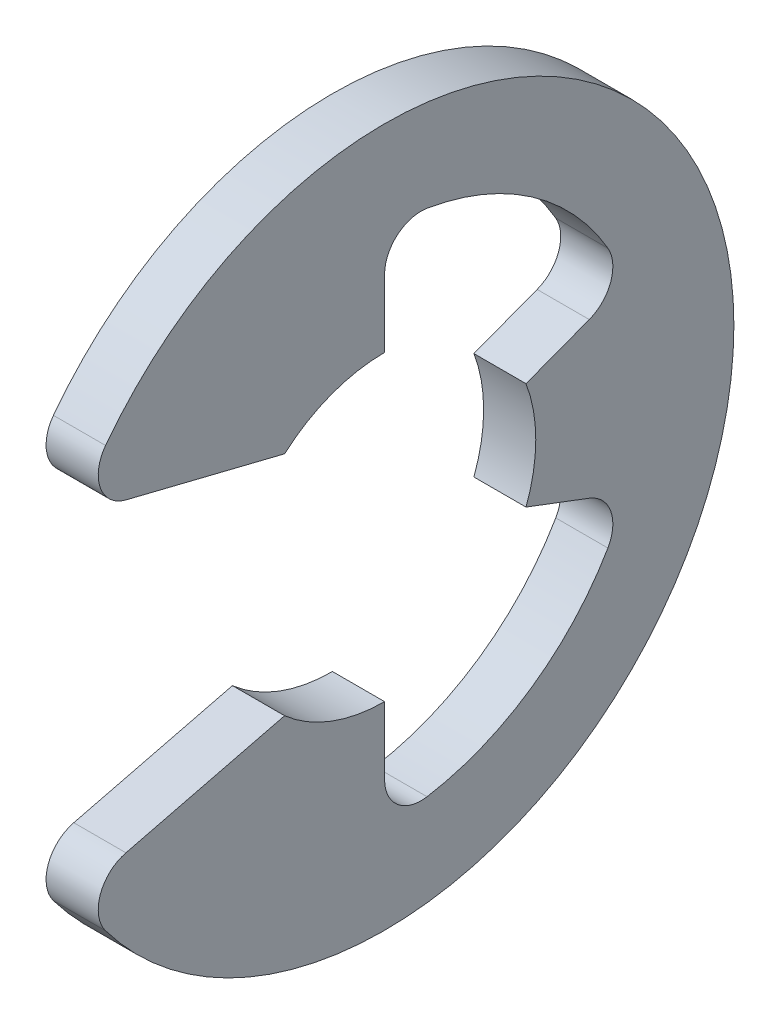
ISO-10303-21;
HEADER;
FILE_DESCRIPTION(('STEP AP214'),'2;1');
FILE_NAME('part.step','',(''),(''),'','','');
FILE_SCHEMA(('AUTOMOTIVE_DESIGN { 1 0 10303 214 1 1 1 1 }'));
ENDSEC;
DATA;
#1=APPLICATION_CONTEXT('core data for automotive mechanical design processes');
#2=APPLICATION_PROTOCOL_DEFINITION('international standard','automotive_design',2000,#1);
#3=PRODUCT_CONTEXT('',#1,'mechanical');
#4=PRODUCT('Part','Part','',(#3));
#5=PRODUCT_RELATED_PRODUCT_CATEGORY('part','',(#4));
#6=PRODUCT_DEFINITION_FORMATION('','',#4);
#7=PRODUCT_DEFINITION_CONTEXT('part definition',#1,'design');
#8=PRODUCT_DEFINITION('design','',#6,#7);
#9=PRODUCT_DEFINITION_SHAPE('','',#8);
#10=(LENGTH_UNIT() NAMED_UNIT(*) SI_UNIT(.MILLI.,.METRE.));
#11=(NAMED_UNIT(*) PLANE_ANGLE_UNIT() SI_UNIT($,.RADIAN.));
#12=(NAMED_UNIT(*) SI_UNIT($,.STERADIAN.) SOLID_ANGLE_UNIT());
#13=UNCERTAINTY_MEASURE_WITH_UNIT(LENGTH_MEASURE(1.E-05),#10,'distance_accuracy_value','');
#14=(GEOMETRIC_REPRESENTATION_CONTEXT(3) GLOBAL_UNCERTAINTY_ASSIGNED_CONTEXT((#13)) GLOBAL_UNIT_ASSIGNED_CONTEXT((#10,
#11,#12)) REPRESENTATION_CONTEXT('',''));
#15=CARTESIAN_POINT('',(0.,0.,0.));
#16=DIRECTION('',(0.,0.,1.));
#17=DIRECTION('',(1.,0.,0.));
#18=AXIS2_PLACEMENT_3D('',#15,#16,#17);
#19=CARTESIAN_POINT('',(0.3175,0.,0.));
#20=DIRECTION('',(-1.,0.,0.));
#21=DIRECTION('',(0.,0.,1.));
#22=AXIS2_PLACEMENT_3D('',#19,#20,#21);
#23=CYLINDRICAL_SURFACE('',#22,4.2545);
#24=CARTESIAN_POINT('',(0.3175,0.,0.));
#25=DIRECTION('',(1.,0.,0.));
#26=DIRECTION('',(0.,0.,-1.));
#27=AXIS2_PLACEMENT_3D('',#24,#25,#26);
#28=CIRCLE('',#27,4.2545);
#29=CARTESIAN_POINT('',(0.3175,-2.55970079348508,3.39833813765374));
#30=VERTEX_POINT('',#29);
#31=CARTESIAN_POINT('',(0.3175,2.55970079348508,3.39833813765374));
#32=VERTEX_POINT('',#31);
#33=EDGE_CURVE('E173',#30,#32,#28,.T.);
#34=ORIENTED_EDGE('',*,*,#33,.F.);
#35=DIRECTION('',(-1.,0.,0.));
#36=VECTOR('',#35,1.);
#37=CARTESIAN_POINT('',(0.3175,-2.55970079348508,3.39833813765374));
#38=LINE('',#37,#36);
#39=CARTESIAN_POINT('',(-0.3175,-2.55970079348508,3.39833813765374));
#40=VERTEX_POINT('',#39);
#41=EDGE_CURVE('E267',#30,#40,#38,.T.);
#42=ORIENTED_EDGE('',*,*,#41,.T.);
#43=CARTESIAN_POINT('',(-0.3175,0.,0.));
#44=DIRECTION('',(1.,0.,0.));
#45=DIRECTION('',(0.,0.,-1.));
#46=AXIS2_PLACEMENT_3D('',#43,#44,#45);
#47=CIRCLE('',#46,4.2545);
#48=CARTESIAN_POINT('',(-0.3175,2.55970079348508,3.39833813765374));
#49=VERTEX_POINT('',#48);
#50=EDGE_CURVE('E211',#40,#49,#47,.T.);
#51=ORIENTED_EDGE('',*,*,#50,.T.);
#52=DIRECTION('',(-1.,0.,0.));
#53=VECTOR('',#52,1.);
#54=CARTESIAN_POINT('',(0.3175,2.55970079348508,3.39833813765374));
#55=LINE('',#54,#53);
#56=EDGE_CURVE('E265',#49,#32,#55,.F.);
#57=ORIENTED_EDGE('',*,*,#56,.T.);
#58=EDGE_LOOP('',(#34,#42,#51,#57));
#59=FACE_BOUND('',#58,.T.);
#60=ADVANCED_FACE('F35',(#59),#23,.T.);
#61=CARTESIAN_POINT('',(0.3175,2.00970746878701,3.74991281764013));
#62=DIRECTION('',(0.,0.970536829925373,-0.240952820606873));
#63=DIRECTION('',(0.,0.240952820606873,0.970536829925373));
#64=AXIS2_PLACEMENT_3D('',#61,#62,#63);
#65=PLANE('',#64);
#66=DIRECTION('',(0.,-0.240952820606873,-0.970536829925373));
#67=VECTOR('',#66,1.);
#68=CARTESIAN_POINT('',(0.3175,2.00970746878701,3.74991281764013));
#69=LINE('',#68,#67);
#70=CARTESIAN_POINT('',(0.3175,1.86086574639824,3.15039141322579));
#71=VERTEX_POINT('',#70);
#72=CARTESIAN_POINT('',(0.3175,1.381125,1.21803775983136));
#73=VERTEX_POINT('',#72);
#74=EDGE_CURVE('E159',#71,#73,#69,.T.);
#75=ORIENTED_EDGE('',*,*,#74,.F.);
#76=DIRECTION('',(-1.,0.,0.));
#77=VECTOR('',#76,1.);
#78=CARTESIAN_POINT('',(0.3175,1.86086574639824,3.15039141322579));
#79=LINE('',#78,#77);
#80=CARTESIAN_POINT('',(-0.3175,1.86086574639824,3.15039141322579));
#81=VERTEX_POINT('',#80);
#82=EDGE_CURVE('E279',#71,#81,#79,.T.);
#83=ORIENTED_EDGE('',*,*,#82,.T.);
#84=DIRECTION('',(0.,-0.240952820606873,-0.970536829925373));
#85=VECTOR('',#84,1.);
#86=CARTESIAN_POINT('',(-0.3175,2.00970746878701,3.74991281764013));
#87=LINE('',#86,#85);
#88=CARTESIAN_POINT('',(-0.3175,1.381125,1.21803775983136));
#89=VERTEX_POINT('',#88);
#90=EDGE_CURVE('E179',#81,#89,#87,.T.);
#91=ORIENTED_EDGE('',*,*,#90,.T.);
#92=DIRECTION('',(-1.,0.,0.));
#93=VECTOR('',#92,1.);
#94=CARTESIAN_POINT('',(0.3175,1.381125,1.21803775983136));
#95=LINE('',#94,#93);
#96=EDGE_CURVE('E176',#73,#89,#95,.T.);
#97=ORIENTED_EDGE('',*,*,#96,.F.);
#98=EDGE_LOOP('',(#75,#83,#91,#97));
#99=FACE_BOUND('',#98,.T.);
#100=ADVANCED_FACE('F177',(#99),#65,.F.);
#101=CARTESIAN_POINT('',(0.3175,0.,0.));
#102=DIRECTION('',(-1.,0.,0.));
#103=DIRECTION('',(0.,0.,1.));
#104=AXIS2_PLACEMENT_3D('',#101,#102,#103);
#105=CYLINDRICAL_SURFACE('',#104,1.8415);
#106=CARTESIAN_POINT('',(-0.3175,0.,0.));
#107=DIRECTION('',(-1.,0.,0.));
#108=DIRECTION('',(0.,0.,1.));
#109=AXIS2_PLACEMENT_3D('',#106,#107,#108);
#110=CIRCLE('',#109,1.8415);
#111=CARTESIAN_POINT('',(-0.3175,1.8415,0.));
#112=VERTEX_POINT('',#111);
#113=EDGE_CURVE('E215',#89,#112,#110,.T.);
#114=ORIENTED_EDGE('',*,*,#113,.T.);
#115=DIRECTION('',(-1.,0.,0.));
#116=VECTOR('',#115,1.);
#117=CARTESIAN_POINT('',(0.3175,1.8415,0.));
#118=LINE('',#117,#116);
#119=CARTESIAN_POINT('',(0.3175,1.8415,0.));
#120=VERTEX_POINT('',#119);
#121=EDGE_CURVE('E183',#120,#112,#118,.T.);
#122=ORIENTED_EDGE('',*,*,#121,.F.);
#123=CARTESIAN_POINT('',(0.3175,0.,0.));
#124=DIRECTION('',(-1.,0.,0.));
#125=DIRECTION('',(0.,0.,1.));
#126=AXIS2_PLACEMENT_3D('',#123,#124,#125);
#127=CIRCLE('',#126,1.8415);
#128=EDGE_CURVE('E165',#73,#120,#127,.T.);
#129=ORIENTED_EDGE('',*,*,#128,.F.);
#130=ORIENTED_EDGE('',*,*,#96,.T.);
#131=EDGE_LOOP('',(#114,#122,#129,#130));
#132=FACE_BOUND('',#131,.T.);
#133=ADVANCED_FACE('F185',(#132),#105,.F.);
#134=CARTESIAN_POINT('',(0.3175,1.8415,0.));
#135=DIRECTION('',(0.,0.,1.));
#136=DIRECTION('',(0.,-1.,0.));
#137=AXIS2_PLACEMENT_3D('',#134,#135,#136);
#138=PLANE('',#137);
#139=DIRECTION('',(0.,1.,0.));
#140=VECTOR('',#139,1.);
#141=CARTESIAN_POINT('',(-0.3175,1.8415,0.));
#142=LINE('',#141,#140);
#143=CARTESIAN_POINT('',(-0.3175,2.66500750604648,0.));
#144=VERTEX_POINT('',#143);
#145=EDGE_CURVE('E217',#112,#144,#142,.T.);
#146=ORIENTED_EDGE('',*,*,#145,.T.);
#147=DIRECTION('',(1.,0.,0.));
#148=VECTOR('',#147,1.);
#149=CARTESIAN_POINT('',(0.3175,2.66500750604648,0.));
#150=LINE('',#149,#148);
#151=CARTESIAN_POINT('',(0.3175,2.66500750604648,0.));
#152=VERTEX_POINT('',#151);
#153=EDGE_CURVE('E263',#144,#152,#150,.T.);
#154=ORIENTED_EDGE('',*,*,#153,.T.);
#155=DIRECTION('',(0.,1.,0.));
#156=VECTOR('',#155,1.);
#157=CARTESIAN_POINT('',(0.3175,1.8415,0.));
#158=LINE('',#157,#156);
#159=EDGE_CURVE('E188',#120,#152,#158,.T.);
#160=ORIENTED_EDGE('',*,*,#159,.F.);
#161=ORIENTED_EDGE('',*,*,#121,.T.);
#162=EDGE_LOOP('',(#146,#154,#160,#161));
#163=FACE_BOUND('',#162,.T.);
#164=ADVANCED_FACE('F385',(#163),#138,.F.);
#165=CARTESIAN_POINT('',(0.3175,0.,0.));
#166=DIRECTION('',(-1.,0.,0.));
#167=DIRECTION('',(0.,0.,1.));
#168=AXIS2_PLACEMENT_3D('',#165,#166,#167);
#169=CYLINDRICAL_SURFACE('',#168,3.14632258064516);
#170=CARTESIAN_POINT('',(0.3175,0.,0.));
#171=DIRECTION('',(-1.,0.,0.));
#172=DIRECTION('',(0.,0.,-1.));
#173=AXIS2_PLACEMENT_3D('',#170,#171,#172);
#174=CIRCLE('',#173,3.14632258064516);
#175=CARTESIAN_POINT('',(0.3175,3.10345074244685,-0.517628506444275));
#176=VERTEX_POINT('',#175);
#177=CARTESIAN_POINT('',(0.3175,1.58143266371679,-2.72000303522022));
#178=VERTEX_POINT('',#177);
#179=EDGE_CURVE('E190',#176,#178,#174,.T.);
#180=ORIENTED_EDGE('',*,*,#179,.F.);
#181=DIRECTION('',(-1.,0.,0.));
#182=VECTOR('',#181,1.);
#183=CARTESIAN_POINT('',(0.3175,3.10345074244685,-0.517628506444275));
#184=LINE('',#183,#182);
#185=CARTESIAN_POINT('',(-0.3175,3.10345074244685,-0.517628506444275));
#186=VERTEX_POINT('',#185);
#187=EDGE_CURVE('E260',#176,#186,#184,.T.);
#188=ORIENTED_EDGE('',*,*,#187,.T.);
#189=CARTESIAN_POINT('',(-0.3175,0.,0.));
#190=DIRECTION('',(-1.,0.,0.));
#191=DIRECTION('',(0.,0.,-1.));
#192=AXIS2_PLACEMENT_3D('',#189,#190,#191);
#193=CIRCLE('',#192,3.14632258064516);
#194=CARTESIAN_POINT('',(-0.3175,1.58143266371679,-2.72000303522022));
#195=VERTEX_POINT('',#194);
#196=EDGE_CURVE('E220',#186,#195,#193,.T.);
#197=ORIENTED_EDGE('',*,*,#196,.T.);
#198=DIRECTION('',(-1.,0.,0.));
#199=VECTOR('',#198,1.);
#200=CARTESIAN_POINT('',(0.3175,1.58143266371679,-2.72000303522023));
#201=LINE('',#200,#199);
#202=EDGE_CURVE('E258',#195,#178,#201,.F.);
#203=ORIENTED_EDGE('',*,*,#202,.T.);
#204=EDGE_LOOP('',(#180,#188,#197,#203));
#205=FACE_BOUND('',#204,.T.);
#206=ADVANCED_FACE('F307',(#205),#169,.F.);
#207=CARTESIAN_POINT('',(0.3175,0.651068568777514,-1.72256551943605));
#208=DIRECTION('',(0.,-0.935414346693485,-0.353553390593274));
#209=DIRECTION('',(0.,0.353553390593274,-0.935414346693485));
#210=AXIS2_PLACEMENT_3D('',#207,#208,#209);
#211=PLANE('',#210);
#212=DIRECTION('',(0.,-0.353553390593274,0.935414346693485));
#213=VECTOR('',#212,1.);
#214=CARTESIAN_POINT('',(0.3175,0.651068568777514,-1.72256551943605));
#215=LINE('',#214,#213);
#216=CARTESIAN_POINT('',(0.3175,0.942222439719258,-2.4928862552017));
#217=VERTEX_POINT('',#216);
#218=CARTESIAN_POINT('',(0.3175,0.651068568777514,-1.72256551943605));
#219=VERTEX_POINT('',#218);
#220=EDGE_CURVE('E195',#217,#219,#215,.T.);
#221=ORIENTED_EDGE('',*,*,#220,.F.);
#222=DIRECTION('',(1.,0.,0.));
#223=VECTOR('',#222,1.);
#224=CARTESIAN_POINT('',(-0.3175,0.942222439719258,-2.4928862552017));
#225=LINE('',#224,#223);
#226=CARTESIAN_POINT('',(-0.3175,0.942222439719258,-2.4928862552017));
#227=VERTEX_POINT('',#226);
#228=EDGE_CURVE('E282',#217,#227,#225,.F.);
#229=ORIENTED_EDGE('',*,*,#228,.T.);
#230=DIRECTION('',(0.,-0.353553390593274,0.935414346693485));
#231=VECTOR('',#230,1.);
#232=CARTESIAN_POINT('',(-0.3175,0.651068568777514,-1.72256551943605));
#233=LINE('',#232,#231);
#234=CARTESIAN_POINT('',(-0.3175,0.651068568777514,-1.72256551943605));
#235=VERTEX_POINT('',#234);
#236=EDGE_CURVE('E223',#227,#235,#233,.T.);
#237=ORIENTED_EDGE('',*,*,#236,.T.);
#238=DIRECTION('',(-1.,0.,0.));
#239=VECTOR('',#238,1.);
#240=CARTESIAN_POINT('',(0.3175,0.651068568777514,-1.72256551943605));
#241=LINE('',#240,#239);
#242=EDGE_CURVE('E247',#219,#235,#241,.T.);
#243=ORIENTED_EDGE('',*,*,#242,.F.);
#244=EDGE_LOOP('',(#221,#229,#237,#243));
#245=FACE_BOUND('',#244,.T.);
#246=ADVANCED_FACE('F310',(#245),#211,.F.);
#247=CARTESIAN_POINT('',(0.3175,0.,0.));
#248=DIRECTION('',(-1.,0.,0.));
#249=DIRECTION('',(0.,0.,1.));
#250=AXIS2_PLACEMENT_3D('',#247,#248,#249);
#251=CYLINDRICAL_SURFACE('',#250,1.8415);
#252=CARTESIAN_POINT('',(-0.3175,0.,0.));
#253=DIRECTION('',(-1.,0.,0.));
#254=DIRECTION('',(0.,0.,1.));
#255=AXIS2_PLACEMENT_3D('',#252,#253,#254);
#256=CIRCLE('',#255,1.8415);
#257=CARTESIAN_POINT('',(-0.3175,-0.651068568777513,-1.72256551943605));
#258=VERTEX_POINT('',#257);
#259=EDGE_CURVE('E225',#235,#258,#256,.T.);
#260=ORIENTED_EDGE('',*,*,#259,.T.);
#261=DIRECTION('',(-1.,0.,0.));
#262=VECTOR('',#261,1.);
#263=CARTESIAN_POINT('',(0.3175,-0.651068568777513,-1.72256551943605));
#264=LINE('',#263,#262);
#265=CARTESIAN_POINT('',(0.3175,-0.651068568777513,-1.72256551943605));
#266=VERTEX_POINT('',#265);
#267=EDGE_CURVE('E244',#266,#258,#264,.T.);
#268=ORIENTED_EDGE('',*,*,#267,.F.);
#269=CARTESIAN_POINT('',(0.3175,0.,0.));
#270=DIRECTION('',(-1.,0.,0.));
#271=DIRECTION('',(0.,0.,1.));
#272=AXIS2_PLACEMENT_3D('',#269,#270,#271);
#273=CIRCLE('',#272,1.8415);
#274=EDGE_CURVE('E197',#219,#266,#273,.T.);
#275=ORIENTED_EDGE('',*,*,#274,.F.);
#276=ORIENTED_EDGE('',*,*,#242,.T.);
#277=EDGE_LOOP('',(#260,#268,#275,#276));
#278=FACE_BOUND('',#277,.T.);
#279=ADVANCED_FACE('F316',(#278),#251,.F.);
#280=CARTESIAN_POINT('',(0.3175,-0.651068568777513,-1.72256551943605));
#281=DIRECTION('',(0.,0.935414346693485,-0.353553390593274));
#282=DIRECTION('',(0.,0.353553390593274,0.935414346693485));
#283=AXIS2_PLACEMENT_3D('',#280,#281,#282);
#284=PLANE('',#283);
#285=DIRECTION('',(0.,-0.353553390593274,-0.935414346693485));
#286=VECTOR('',#285,1.);
#287=CARTESIAN_POINT('',(-0.3175,-0.651068568777513,-1.72256551943605));
#288=LINE('',#287,#286);
#289=CARTESIAN_POINT('',(-0.3175,-0.942222439719257,-2.4928862552017));
#290=VERTEX_POINT('',#289);
#291=EDGE_CURVE('E227',#258,#290,#288,.T.);
#292=ORIENTED_EDGE('',*,*,#291,.T.);
#293=DIRECTION('',(1.,0.,0.));
#294=VECTOR('',#293,1.);
#295=CARTESIAN_POINT('',(0.3175,-0.942222439719257,-2.4928862552017));
#296=LINE('',#295,#294);
#297=CARTESIAN_POINT('',(0.3175,-0.942222439719257,-2.4928862552017));
#298=VERTEX_POINT('',#297);
#299=EDGE_CURVE('E50',#290,#298,#296,.T.);
#300=ORIENTED_EDGE('',*,*,#299,.T.);
#301=DIRECTION('',(0.,-0.353553390593274,-0.935414346693485));
#302=VECTOR('',#301,1.);
#303=CARTESIAN_POINT('',(0.3175,-0.651068568777513,-1.72256551943605));
#304=LINE('',#303,#302);
#305=EDGE_CURVE('E199',#266,#298,#304,.T.);
#306=ORIENTED_EDGE('',*,*,#305,.F.);
#307=ORIENTED_EDGE('',*,*,#267,.T.);
#308=EDGE_LOOP('',(#292,#300,#306,#307));
#309=FACE_BOUND('',#308,.T.);
#310=ADVANCED_FACE('F318',(#309),#284,.F.);
#311=CARTESIAN_POINT('',(0.3175,0.,0.));
#312=DIRECTION('',(-1.,0.,0.));
#313=DIRECTION('',(0.,0.,1.));
#314=AXIS2_PLACEMENT_3D('',#311,#312,#313);
#315=CYLINDRICAL_SURFACE('',#314,3.14632258064516);
#316=CARTESIAN_POINT('',(-0.3175,0.,0.));
#317=DIRECTION('',(-1.,0.,0.));
#318=DIRECTION('',(0.,0.,-1.));
#319=AXIS2_PLACEMENT_3D('',#316,#317,#318);
#320=CIRCLE('',#319,3.14632258064516);
#321=CARTESIAN_POINT('',(-0.3175,-1.58143266371679,-2.72000303522023));
#322=VERTEX_POINT('',#321);
#323=CARTESIAN_POINT('',(-0.3175,-3.10345074244685,-0.517628506444276));
#324=VERTEX_POINT('',#323);
#325=EDGE_CURVE('E229',#322,#324,#320,.T.);
#326=ORIENTED_EDGE('',*,*,#325,.T.);
#327=DIRECTION('',(-1.,0.,0.));
#328=VECTOR('',#327,1.);
#329=CARTESIAN_POINT('',(0.3175,-3.10345074244685,-0.517628506444276));
#330=LINE('',#329,#328);
#331=CARTESIAN_POINT('',(0.3175,-3.10345074244685,-0.517628506444276));
#332=VERTEX_POINT('',#331);
#333=EDGE_CURVE('E256',#324,#332,#330,.F.);
#334=ORIENTED_EDGE('',*,*,#333,.T.);
#335=CARTESIAN_POINT('',(0.3175,0.,0.));
#336=DIRECTION('',(-1.,0.,0.));
#337=DIRECTION('',(0.,0.,-1.));
#338=AXIS2_PLACEMENT_3D('',#335,#336,#337);
#339=CIRCLE('',#338,3.14632258064516);
#340=CARTESIAN_POINT('',(0.3175,-1.58143266371679,-2.72000303522023));
#341=VERTEX_POINT('',#340);
#342=EDGE_CURVE('E201',#341,#332,#339,.T.);
#343=ORIENTED_EDGE('',*,*,#342,.F.);
#344=DIRECTION('',(-1.,0.,0.));
#345=VECTOR('',#344,1.);
#346=CARTESIAN_POINT('',(0.3175,-1.58143266371679,-2.72000303522023));
#347=LINE('',#346,#345);
#348=EDGE_CURVE('E253',#341,#322,#347,.T.);
#349=ORIENTED_EDGE('',*,*,#348,.T.);
#350=EDGE_LOOP('',(#326,#334,#343,#349));
#351=FACE_BOUND('',#350,.T.);
#352=ADVANCED_FACE('F320',(#351),#315,.F.);
#353=CARTESIAN_POINT('',(0.3175,-1.8415,0.));
#354=DIRECTION('',(0.,0.,1.));
#355=DIRECTION('',(0.,-1.,0.));
#356=AXIS2_PLACEMENT_3D('',#353,#354,#355);
#357=PLANE('',#356);
#358=DIRECTION('',(0.,1.,0.));
#359=VECTOR('',#358,1.);
#360=CARTESIAN_POINT('',(0.3175,-1.8415,0.));
#361=LINE('',#360,#359);
#362=CARTESIAN_POINT('',(0.3175,-2.66500750604648,0.));
#363=VERTEX_POINT('',#362);
#364=CARTESIAN_POINT('',(0.3175,-1.8415,0.));
#365=VERTEX_POINT('',#364);
#366=EDGE_CURVE('E204',#363,#365,#361,.T.);
#367=ORIENTED_EDGE('',*,*,#366,.F.);
#368=DIRECTION('',(1.,0.,0.));
#369=VECTOR('',#368,1.);
#370=CARTESIAN_POINT('',(-0.3175,-2.66500750604648,0.));
#371=LINE('',#370,#369);
#372=CARTESIAN_POINT('',(-0.3175,-2.66500750604648,0.));
#373=VERTEX_POINT('',#372);
#374=EDGE_CURVE('E182',#363,#373,#371,.F.);
#375=ORIENTED_EDGE('',*,*,#374,.T.);
#376=DIRECTION('',(0.,1.,0.));
#377=VECTOR('',#376,1.);
#378=CARTESIAN_POINT('',(-0.3175,-1.8415,0.));
#379=LINE('',#378,#377);
#380=CARTESIAN_POINT('',(-0.3175,-1.8415,0.));
#381=VERTEX_POINT('',#380);
#382=EDGE_CURVE('E232',#373,#381,#379,.T.);
#383=ORIENTED_EDGE('',*,*,#382,.T.);
#384=DIRECTION('',(-1.,0.,0.));
#385=VECTOR('',#384,1.);
#386=CARTESIAN_POINT('',(0.3175,-1.8415,0.));
#387=LINE('',#386,#385);
#388=EDGE_CURVE('E241',#365,#381,#387,.T.);
#389=ORIENTED_EDGE('',*,*,#388,.F.);
#390=EDGE_LOOP('',(#367,#375,#383,#389));
#391=FACE_BOUND('',#390,.T.);
#392=ADVANCED_FACE('F326',(#391),#357,.F.);
#393=CARTESIAN_POINT('',(0.3175,0.,0.));
#394=DIRECTION('',(-1.,0.,0.));
#395=DIRECTION('',(0.,0.,1.));
#396=AXIS2_PLACEMENT_3D('',#393,#394,#395);
#397=CYLINDRICAL_SURFACE('',#396,1.8415);
#398=CARTESIAN_POINT('',(-0.3175,0.,0.));
#399=DIRECTION('',(-1.,0.,0.));
#400=DIRECTION('',(0.,0.,-1.));
#401=AXIS2_PLACEMENT_3D('',#398,#399,#400);
#402=CIRCLE('',#401,1.8415);
#403=CARTESIAN_POINT('',(-0.3175,-1.381125,1.21803775983136));
#404=VERTEX_POINT('',#403);
#405=EDGE_CURVE('E234',#381,#404,#402,.T.);
#406=ORIENTED_EDGE('',*,*,#405,.T.);
#407=DIRECTION('',(-1.,0.,0.));
#408=VECTOR('',#407,1.);
#409=CARTESIAN_POINT('',(0.3175,-1.381125,1.21803775983136));
#410=LINE('',#409,#408);
#411=CARTESIAN_POINT('',(0.3175,-1.381125,1.21803775983136));
#412=VERTEX_POINT('',#411);
#413=EDGE_CURVE('E210',#412,#404,#410,.T.);
#414=ORIENTED_EDGE('',*,*,#413,.F.);
#415=CARTESIAN_POINT('',(0.3175,0.,0.));
#416=DIRECTION('',(-1.,0.,0.));
#417=DIRECTION('',(0.,0.,-1.));
#418=AXIS2_PLACEMENT_3D('',#415,#416,#417);
#419=CIRCLE('',#418,1.8415);
#420=EDGE_CURVE('E206',#365,#412,#419,.T.);
#421=ORIENTED_EDGE('',*,*,#420,.F.);
#422=ORIENTED_EDGE('',*,*,#388,.T.);
#423=EDGE_LOOP('',(#406,#414,#421,#422));
#424=FACE_BOUND('',#423,.T.);
#425=ADVANCED_FACE('F375',(#424),#397,.F.);
#426=CARTESIAN_POINT('',(0.3175,-2.00970746878701,3.74991281764013));
#427=DIRECTION('',(0.,-0.970536829925373,-0.240952820606873));
#428=DIRECTION('',(0.,0.240952820606873,-0.970536829925373));
#429=AXIS2_PLACEMENT_3D('',#426,#427,#428);
#430=PLANE('',#429);
#431=DIRECTION('',(0.,-0.240952820606873,0.970536829925373));
#432=VECTOR('',#431,1.);
#433=CARTESIAN_POINT('',(-0.3175,-2.00970746878701,3.74991281764013));
#434=LINE('',#433,#432);
#435=CARTESIAN_POINT('',(-0.3175,-1.86086574639824,3.15039141322579));
#436=VERTEX_POINT('',#435);
#437=EDGE_CURVE('E236',#404,#436,#434,.T.);
#438=ORIENTED_EDGE('',*,*,#437,.T.);
#439=DIRECTION('',(-1.,0.,0.));
#440=VECTOR('',#439,1.);
#441=CARTESIAN_POINT('',(0.3175,-1.86086574639824,3.15039141322579));
#442=LINE('',#441,#440);
#443=CARTESIAN_POINT('',(0.3175,-1.86086574639824,3.15039141322579));
#444=VERTEX_POINT('',#443);
#445=EDGE_CURVE('E274',#436,#444,#442,.F.);
#446=ORIENTED_EDGE('',*,*,#445,.T.);
#447=DIRECTION('',(0.,-0.240952820606873,0.970536829925373));
#448=VECTOR('',#447,1.);
#449=CARTESIAN_POINT('',(0.3175,-2.00970746878701,3.74991281764013));
#450=LINE('',#449,#448);
#451=EDGE_CURVE('E208',#412,#444,#450,.T.);
#452=ORIENTED_EDGE('',*,*,#451,.F.);
#453=ORIENTED_EDGE('',*,*,#413,.T.);
#454=EDGE_LOOP('',(#438,#446,#452,#453));
#455=FACE_BOUND('',#454,.T.);
#456=ADVANCED_FACE('F417',(#455),#430,.F.);
#457=CARTESIAN_POINT('',(0.3175,0.,0.));
#458=DIRECTION('',(1.,0.,0.));
#459=DIRECTION('',(0.,0.,-1.));
#460=AXIS2_PLACEMENT_3D('',#457,#458,#459);
#461=PLANE('',#460);
#462=ORIENTED_EDGE('',*,*,#451,.T.);
#463=CARTESIAN_POINT('',(0.3175,-2.29226936730007,3.04328788446603));
#464=DIRECTION('',(1.,0.,0.));
#465=DIRECTION('',(0.,0.,-1.));
#466=AXIS2_PLACEMENT_3D('',#463,#464,#465);
#467=CIRCLE('',#466,0.4445);
#468=EDGE_CURVE('E277',#444,#30,#467,.T.);
#469=ORIENTED_EDGE('',*,*,#468,.T.);
#470=ORIENTED_EDGE('',*,*,#33,.T.);
#471=CARTESIAN_POINT('',(0.3175,2.29226936730007,3.04328788446603));
#472=DIRECTION('',(1.,0.,0.));
#473=DIRECTION('',(0.,0.,-1.));
#474=AXIS2_PLACEMENT_3D('',#471,#472,#473);
#475=CIRCLE('',#474,0.4445);
#476=EDGE_CURVE('E169',#32,#71,#475,.T.);
#477=ORIENTED_EDGE('',*,*,#476,.T.);
#478=ORIENTED_EDGE('',*,*,#74,.T.);
#479=ORIENTED_EDGE('',*,*,#128,.T.);
#480=ORIENTED_EDGE('',*,*,#159,.T.);
#481=CARTESIAN_POINT('',(0.3175,2.66500750604648,-0.444499999999999));
#482=DIRECTION('',(1.,0.,0.));
#483=DIRECTION('',(0.,0.,-1.));
#484=AXIS2_PLACEMENT_3D('',#481,#482,#483);
#485=CIRCLE('',#484,0.4445);
#486=EDGE_CURVE('E291',#152,#176,#485,.F.);
#487=ORIENTED_EDGE('',*,*,#486,.T.);
#488=ORIENTED_EDGE('',*,*,#179,.T.);
#489=CARTESIAN_POINT('',(0.3175,1.35801411682451,-2.33573177308299));
#490=DIRECTION('',(1.,0.,0.));
#491=DIRECTION('',(0.,0.,-1.));
#492=AXIS2_PLACEMENT_3D('',#489,#490,#491);
#493=CIRCLE('',#492,0.4445);
#494=EDGE_CURVE('E11',#178,#217,#493,.F.);
#495=ORIENTED_EDGE('',*,*,#494,.T.);
#496=ORIENTED_EDGE('',*,*,#220,.T.);
#497=ORIENTED_EDGE('',*,*,#274,.T.);
#498=ORIENTED_EDGE('',*,*,#305,.T.);
#499=CARTESIAN_POINT('',(0.3175,-1.35801411682451,-2.33573177308299));
#500=DIRECTION('',(1.,0.,0.));
#501=DIRECTION('',(0.,0.,-1.));
#502=AXIS2_PLACEMENT_3D('',#499,#500,#501);
#503=CIRCLE('',#502,0.4445);
#504=EDGE_CURVE('E295',#298,#341,#503,.F.);
#505=ORIENTED_EDGE('',*,*,#504,.T.);
#506=ORIENTED_EDGE('',*,*,#342,.T.);
#507=CARTESIAN_POINT('',(0.3175,-2.66500750604648,-0.4445));
#508=DIRECTION('',(1.,0.,0.));
#509=DIRECTION('',(0.,0.,-1.));
#510=AXIS2_PLACEMENT_3D('',#507,#508,#509);
#511=CIRCLE('',#510,0.4445);
#512=EDGE_CURVE('E287',#332,#363,#511,.F.);
#513=ORIENTED_EDGE('',*,*,#512,.T.);
#514=ORIENTED_EDGE('',*,*,#366,.T.);
#515=ORIENTED_EDGE('',*,*,#420,.T.);
#516=EDGE_LOOP('',(#462,#469,#470,#477,#478,#479,#480,#487,#488,#495,#496,#497,#498,#505,#506,
#513,#514,#515));
#517=FACE_BOUND('',#516,.T.);
#518=ADVANCED_FACE('F162',(#517),#461,.T.);
#519=CARTESIAN_POINT('',(-0.3175,0.,0.));
#520=DIRECTION('',(1.,0.,0.));
#521=DIRECTION('',(0.,0.,-1.));
#522=AXIS2_PLACEMENT_3D('',#519,#520,#521);
#523=PLANE('',#522);
#524=ORIENTED_EDGE('',*,*,#50,.F.);
#525=CARTESIAN_POINT('',(-0.3175,-2.29226936730007,3.04328788446603));
#526=DIRECTION('',(1.,0.,0.));
#527=DIRECTION('',(0.,0.,-1.));
#528=AXIS2_PLACEMENT_3D('',#525,#526,#527);
#529=CIRCLE('',#528,0.4445);
#530=EDGE_CURVE('E272',#40,#436,#529,.F.);
#531=ORIENTED_EDGE('',*,*,#530,.T.);
#532=ORIENTED_EDGE('',*,*,#437,.F.);
#533=ORIENTED_EDGE('',*,*,#405,.F.);
#534=ORIENTED_EDGE('',*,*,#382,.F.);
#535=CARTESIAN_POINT('',(-0.3175,-2.66500750604648,-0.4445));
#536=DIRECTION('',(1.,0.,0.));
#537=DIRECTION('',(0.,0.,-1.));
#538=AXIS2_PLACEMENT_3D('',#535,#536,#537);
#539=CIRCLE('',#538,0.4445);
#540=EDGE_CURVE('E285',#373,#324,#539,.T.);
#541=ORIENTED_EDGE('',*,*,#540,.T.);
#542=ORIENTED_EDGE('',*,*,#325,.F.);
#543=CARTESIAN_POINT('',(-0.3175,-1.35801411682451,-2.33573177308299));
#544=DIRECTION('',(1.,0.,0.));
#545=DIRECTION('',(0.,0.,-1.));
#546=AXIS2_PLACEMENT_3D('',#543,#544,#545);
#547=CIRCLE('',#546,0.4445);
#548=EDGE_CURVE('E293',#322,#290,#547,.T.);
#549=ORIENTED_EDGE('',*,*,#548,.T.);
#550=ORIENTED_EDGE('',*,*,#291,.F.);
#551=ORIENTED_EDGE('',*,*,#259,.F.);
#552=ORIENTED_EDGE('',*,*,#236,.F.);
#553=CARTESIAN_POINT('',(-0.3175,1.35801411682451,-2.33573177308299));
#554=DIRECTION('',(1.,0.,0.));
#555=DIRECTION('',(0.,0.,-1.));
#556=AXIS2_PLACEMENT_3D('',#553,#554,#555);
#557=CIRCLE('',#556,0.4445);
#558=EDGE_CURVE('E43',#227,#195,#557,.T.);
#559=ORIENTED_EDGE('',*,*,#558,.T.);
#560=ORIENTED_EDGE('',*,*,#196,.F.);
#561=CARTESIAN_POINT('',(-0.3175,2.66500750604648,-0.444499999999999));
#562=DIRECTION('',(1.,0.,0.));
#563=DIRECTION('',(0.,0.,-1.));
#564=AXIS2_PLACEMENT_3D('',#561,#562,#563);
#565=CIRCLE('',#564,0.4445);
#566=EDGE_CURVE('E289',#186,#144,#565,.T.);
#567=ORIENTED_EDGE('',*,*,#566,.T.);
#568=ORIENTED_EDGE('',*,*,#145,.F.);
#569=ORIENTED_EDGE('',*,*,#113,.F.);
#570=ORIENTED_EDGE('',*,*,#90,.F.);
#571=CARTESIAN_POINT('',(-0.3175,2.29226936730007,3.04328788446603));
#572=DIRECTION('',(1.,0.,0.));
#573=DIRECTION('',(0.,0.,-1.));
#574=AXIS2_PLACEMENT_3D('',#571,#572,#573);
#575=CIRCLE('',#574,0.4445);
#576=EDGE_CURVE('E270',#81,#49,#575,.F.);
#577=ORIENTED_EDGE('',*,*,#576,.T.);
#578=EDGE_LOOP('',(#524,#531,#532,#533,#534,#541,#542,#549,#550,#551,#552,#559,#560,#567,#568,
#569,#570,#577));
#579=FACE_BOUND('',#578,.T.);
#580=ADVANCED_FACE('F300',(#579),#523,.F.);
#581=CARTESIAN_POINT('',(0.3175,-2.66500750604648,-0.4445));
#582=DIRECTION('',(-1.,0.,0.));
#583=DIRECTION('',(0.,0.,1.));
#584=AXIS2_PLACEMENT_3D('',#581,#582,#583);
#585=CYLINDRICAL_SURFACE('',#584,0.4445);
#586=ORIENTED_EDGE('',*,*,#512,.F.);
#587=ORIENTED_EDGE('',*,*,#333,.F.);
#588=ORIENTED_EDGE('',*,*,#540,.F.);
#589=ORIENTED_EDGE('',*,*,#374,.F.);
#590=EDGE_LOOP('',(#586,#587,#588,#589));
#591=FACE_BOUND('',#590,.T.);
#592=ADVANCED_FACE('F340',(#591),#585,.F.);
#593=CARTESIAN_POINT('',(0.3175,2.66500750604648,-0.444499999999999));
#594=DIRECTION('',(-1.,0.,0.));
#595=DIRECTION('',(0.,0.,1.));
#596=AXIS2_PLACEMENT_3D('',#593,#594,#595);
#597=CYLINDRICAL_SURFACE('',#596,0.4445);
#598=ORIENTED_EDGE('',*,*,#486,.F.);
#599=ORIENTED_EDGE('',*,*,#153,.F.);
#600=ORIENTED_EDGE('',*,*,#566,.F.);
#601=ORIENTED_EDGE('',*,*,#187,.F.);
#602=EDGE_LOOP('',(#598,#599,#600,#601));
#603=FACE_BOUND('',#602,.T.);
#604=ADVANCED_FACE('F343',(#603),#597,.F.);
#605=CARTESIAN_POINT('',(0.3175,-2.29226936730007,3.04328788446603));
#606=DIRECTION('',(-1.,0.,0.));
#607=DIRECTION('',(0.,0.,1.));
#608=AXIS2_PLACEMENT_3D('',#605,#606,#607);
#609=CYLINDRICAL_SURFACE('',#608,0.4445);
#610=ORIENTED_EDGE('',*,*,#468,.F.);
#611=ORIENTED_EDGE('',*,*,#445,.F.);
#612=ORIENTED_EDGE('',*,*,#530,.F.);
#613=ORIENTED_EDGE('',*,*,#41,.F.);
#614=EDGE_LOOP('',(#610,#611,#612,#613));
#615=FACE_BOUND('',#614,.T.);
#616=ADVANCED_FACE('F347',(#615),#609,.T.);
#617=CARTESIAN_POINT('',(0.3175,2.29226936730007,3.04328788446603));
#618=DIRECTION('',(-1.,0.,0.));
#619=DIRECTION('',(0.,0.,1.));
#620=AXIS2_PLACEMENT_3D('',#617,#618,#619);
#621=CYLINDRICAL_SURFACE('',#620,0.4445);
#622=ORIENTED_EDGE('',*,*,#476,.F.);
#623=ORIENTED_EDGE('',*,*,#56,.F.);
#624=ORIENTED_EDGE('',*,*,#576,.F.);
#625=ORIENTED_EDGE('',*,*,#82,.F.);
#626=EDGE_LOOP('',(#622,#623,#624,#625));
#627=FACE_BOUND('',#626,.T.);
#628=ADVANCED_FACE('F351',(#627),#621,.T.);
#629=CARTESIAN_POINT('',(0.3175,-1.35801411682451,-2.33573177308299));
#630=DIRECTION('',(-1.,0.,0.));
#631=DIRECTION('',(0.,0.,1.));
#632=AXIS2_PLACEMENT_3D('',#629,#630,#631);
#633=CYLINDRICAL_SURFACE('',#632,0.4445);
#634=ORIENTED_EDGE('',*,*,#504,.F.);
#635=ORIENTED_EDGE('',*,*,#299,.F.);
#636=ORIENTED_EDGE('',*,*,#548,.F.);
#637=ORIENTED_EDGE('',*,*,#348,.F.);
#638=EDGE_LOOP('',(#634,#635,#636,#637));
#639=FACE_BOUND('',#638,.T.);
#640=ADVANCED_FACE('F354',(#639),#633,.F.);
#641=CARTESIAN_POINT('',(0.3175,1.35801411682451,-2.33573177308299));
#642=DIRECTION('',(-1.,0.,0.));
#643=DIRECTION('',(0.,0.,1.));
#644=AXIS2_PLACEMENT_3D('',#641,#642,#643);
#645=CYLINDRICAL_SURFACE('',#644,0.4445);
#646=ORIENTED_EDGE('',*,*,#494,.F.);
#647=ORIENTED_EDGE('',*,*,#202,.F.);
#648=ORIENTED_EDGE('',*,*,#558,.F.);
#649=ORIENTED_EDGE('',*,*,#228,.F.);
#650=EDGE_LOOP('',(#646,#647,#648,#649));
#651=FACE_BOUND('',#650,.T.);
#652=ADVANCED_FACE('F37',(#651),#645,.F.);
#653=CLOSED_SHELL('',(#60,#100,#133,#164,#206,#246,#279,#310,#352,#392,#425,#456,#518,#580,#592,
#604,#616,#628,#640,#652));
#654=MANIFOLD_SOLID_BREP('B2',#653);
#655=ADVANCED_BREP_SHAPE_REPRESENTATION('',(#18,#654),#14);
#656=SHAPE_DEFINITION_REPRESENTATION(#9,#655);
ENDSEC;
END-ISO-10303-21;
